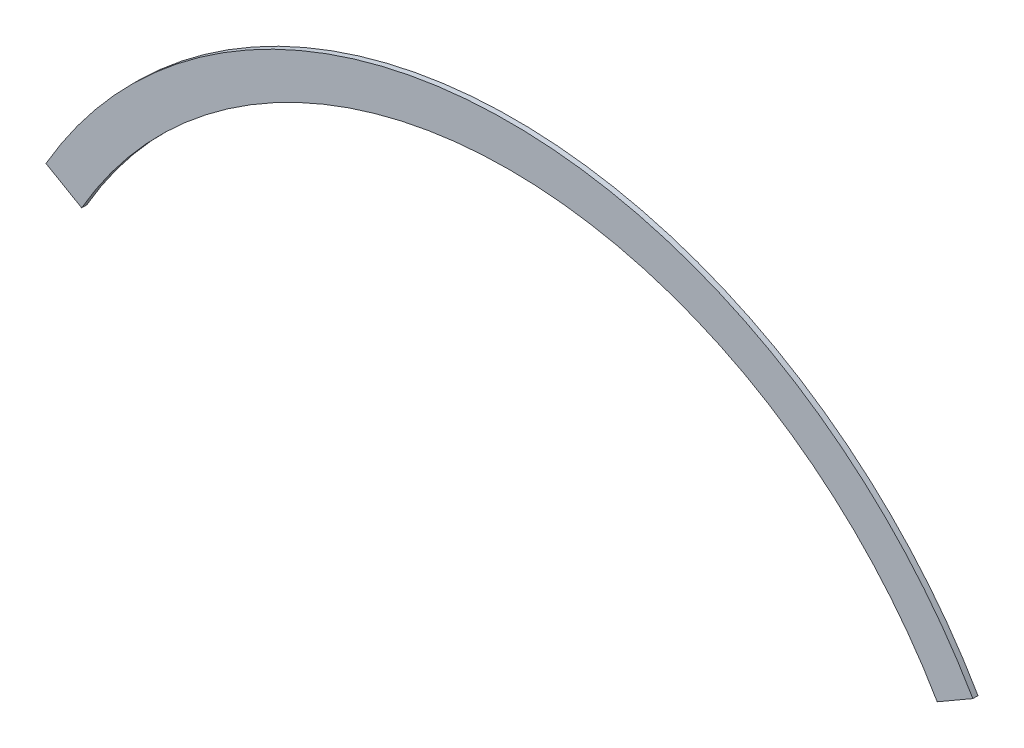
ISO-10303-21;
HEADER;
FILE_DESCRIPTION(('STEP AP214'),'2;1');
FILE_NAME('part.step','',(''),(''),'','','');
FILE_SCHEMA(('AUTOMOTIVE_DESIGN { 1 0 10303 214 1 1 1 1 }'));
ENDSEC;
DATA;
#1=APPLICATION_CONTEXT('core data for automotive mechanical design processes');
#2=APPLICATION_PROTOCOL_DEFINITION('international standard','automotive_design',2000,#1);
#3=PRODUCT_CONTEXT('',#1,'mechanical');
#4=PRODUCT('Part','Part','',(#3));
#5=PRODUCT_RELATED_PRODUCT_CATEGORY('part','',(#4));
#6=PRODUCT_DEFINITION_FORMATION('','',#4);
#7=PRODUCT_DEFINITION_CONTEXT('part definition',#1,'design');
#8=PRODUCT_DEFINITION('design','',#6,#7);
#9=PRODUCT_DEFINITION_SHAPE('','',#8);
#10=(LENGTH_UNIT() NAMED_UNIT(*) SI_UNIT(.MILLI.,.METRE.));
#11=(NAMED_UNIT(*) PLANE_ANGLE_UNIT() SI_UNIT($,.RADIAN.));
#12=(NAMED_UNIT(*) SI_UNIT($,.STERADIAN.) SOLID_ANGLE_UNIT());
#13=UNCERTAINTY_MEASURE_WITH_UNIT(LENGTH_MEASURE(1.E-05),#10,'distance_accuracy_value','');
#14=(GEOMETRIC_REPRESENTATION_CONTEXT(3) GLOBAL_UNCERTAINTY_ASSIGNED_CONTEXT((#13)) GLOBAL_UNIT_ASSIGNED_CONTEXT((#10,
#11,#12)) REPRESENTATION_CONTEXT('',''));
#15=CARTESIAN_POINT('',(0.,0.,0.));
#16=DIRECTION('',(0.,0.,1.));
#17=DIRECTION('',(1.,0.,0.));
#18=AXIS2_PLACEMENT_3D('',#15,#16,#17);
#19=CARTESIAN_POINT('',(0.,0.,1.5875));
#20=DIRECTION('',(0.,0.,-1.));
#21=DIRECTION('',(-1.,0.,0.));
#22=AXIS2_PLACEMENT_3D('',#19,#20,#21);
#23=CYLINDRICAL_SURFACE('',#22,165.1);
#24=CARTESIAN_POINT('',(0.,0.,0.));
#25=DIRECTION('',(0.,0.,1.));
#26=DIRECTION('',(-1.,0.,0.));
#27=AXIS2_PLACEMENT_3D('',#24,#25,#26);
#28=CIRCLE('',#27,165.1);
#29=CARTESIAN_POINT('',(142.980794164811,82.5500000000002,0.));
#30=VERTEX_POINT('',#29);
#31=CARTESIAN_POINT('',(-142.980794164811,82.5500000000002,0.));
#32=VERTEX_POINT('',#31);
#33=EDGE_CURVE('E96',#30,#32,#28,.T.);
#34=ORIENTED_EDGE('',*,*,#33,.T.);
#35=DIRECTION('',(0.,0.,-1.));
#36=VECTOR('',#35,1.);
#37=CARTESIAN_POINT('',(-142.980794164811,82.5500000000002,1.5875));
#38=LINE('',#37,#36);
#39=CARTESIAN_POINT('',(-142.980794164811,82.5500000000002,1.5875));
#40=VERTEX_POINT('',#39);
#41=EDGE_CURVE('E11',#40,#32,#38,.T.);
#42=ORIENTED_EDGE('',*,*,#41,.F.);
#43=CARTESIAN_POINT('',(0.,0.,1.5875));
#44=DIRECTION('',(0.,0.,1.));
#45=DIRECTION('',(-1.,0.,0.));
#46=AXIS2_PLACEMENT_3D('',#43,#44,#45);
#47=CIRCLE('',#46,165.1);
#48=CARTESIAN_POINT('',(142.980794164811,82.5500000000002,1.5875));
#49=VERTEX_POINT('',#48);
#50=EDGE_CURVE('E84',#49,#40,#47,.T.);
#51=ORIENTED_EDGE('',*,*,#50,.F.);
#52=DIRECTION('',(0.,0.,-1.));
#53=VECTOR('',#52,1.);
#54=CARTESIAN_POINT('',(142.980794164811,82.5500000000002,1.5875));
#55=LINE('',#54,#53);
#56=EDGE_CURVE('E92',#49,#30,#55,.T.);
#57=ORIENTED_EDGE('',*,*,#56,.T.);
#58=EDGE_LOOP('',(#34,#42,#51,#57));
#59=FACE_BOUND('',#58,.T.);
#60=ADVANCED_FACE('F33',(#59),#23,.T.);
#61=CARTESIAN_POINT('',(-142.980794164811,82.5500000000002,1.5875));
#62=DIRECTION('',(0.500000000000003,0.866025403784437,0.));
#63=DIRECTION('',(-0.866025403784437,0.500000000000003,0.));
#64=AXIS2_PLACEMENT_3D('',#61,#62,#63);
#65=PLANE('',#64);
#66=DIRECTION('',(0.866025403784437,-0.500000000000003,0.));
#67=VECTOR('',#66,1.);
#68=CARTESIAN_POINT('',(-142.980794164811,82.5500000000002,0.));
#69=LINE('',#68,#67);
#70=CARTESIAN_POINT('',(-131.982271536748,76.2000000000001,0.));
#71=VERTEX_POINT('',#70);
#72=EDGE_CURVE('E88',#32,#71,#69,.T.);
#73=ORIENTED_EDGE('',*,*,#72,.T.);
#74=DIRECTION('',(0.,0.,-1.));
#75=VECTOR('',#74,1.);
#76=CARTESIAN_POINT('',(-131.982271536748,76.2000000000001,1.5875));
#77=LINE('',#76,#75);
#78=CARTESIAN_POINT('',(-131.982271536748,76.2000000000001,1.5875));
#79=VERTEX_POINT('',#78);
#80=EDGE_CURVE('E41',#79,#71,#77,.T.);
#81=ORIENTED_EDGE('',*,*,#80,.F.);
#82=DIRECTION('',(0.866025403784437,-0.500000000000003,0.));
#83=VECTOR('',#82,1.);
#84=CARTESIAN_POINT('',(-142.980794164811,82.5500000000002,1.5875));
#85=LINE('',#84,#83);
#86=EDGE_CURVE('E79',#40,#79,#85,.T.);
#87=ORIENTED_EDGE('',*,*,#86,.F.);
#88=ORIENTED_EDGE('',*,*,#41,.T.);
#89=EDGE_LOOP('',(#73,#81,#87,#88));
#90=FACE_BOUND('',#89,.T.);
#91=ADVANCED_FACE('F87',(#90),#65,.F.);
#92=CARTESIAN_POINT('',(0.,0.,1.5875));
#93=DIRECTION('',(0.,0.,-1.));
#94=DIRECTION('',(-1.,0.,0.));
#95=AXIS2_PLACEMENT_3D('',#92,#93,#94);
#96=CYLINDRICAL_SURFACE('',#95,152.4);
#97=CARTESIAN_POINT('',(0.,0.,0.));
#98=DIRECTION('',(0.,0.,-1.));
#99=DIRECTION('',(-1.,0.,0.));
#100=AXIS2_PLACEMENT_3D('',#97,#98,#99);
#101=CIRCLE('',#100,152.4);
#102=CARTESIAN_POINT('',(131.982271536748,76.2000000000001,0.));
#103=VERTEX_POINT('',#102);
#104=EDGE_CURVE('E66',#71,#103,#101,.T.);
#105=ORIENTED_EDGE('',*,*,#104,.T.);
#106=DIRECTION('',(0.,0.,-1.));
#107=VECTOR('',#106,1.);
#108=CARTESIAN_POINT('',(131.982271536748,76.2000000000001,1.5875));
#109=LINE('',#108,#107);
#110=CARTESIAN_POINT('',(131.982271536748,76.2000000000001,1.5875));
#111=VERTEX_POINT('',#110);
#112=EDGE_CURVE('E89',#111,#103,#109,.T.);
#113=ORIENTED_EDGE('',*,*,#112,.F.);
#114=CARTESIAN_POINT('',(0.,0.,1.5875));
#115=DIRECTION('',(0.,0.,-1.));
#116=DIRECTION('',(-1.,0.,0.));
#117=AXIS2_PLACEMENT_3D('',#114,#115,#116);
#118=CIRCLE('',#117,152.4);
#119=EDGE_CURVE('E82',#79,#111,#118,.T.);
#120=ORIENTED_EDGE('',*,*,#119,.F.);
#121=ORIENTED_EDGE('',*,*,#80,.T.);
#122=EDGE_LOOP('',(#105,#113,#120,#121));
#123=FACE_BOUND('',#122,.T.);
#124=ADVANCED_FACE('F90',(#123),#96,.F.);
#125=CARTESIAN_POINT('',(131.982271536748,76.2000000000001,1.5875));
#126=DIRECTION('',(-0.500000000000003,0.866025403784437,0.));
#127=DIRECTION('',(-0.866025403784437,-0.500000000000003,0.));
#128=AXIS2_PLACEMENT_3D('',#125,#126,#127);
#129=PLANE('',#128);
#130=DIRECTION('',(0.866025403784437,0.500000000000003,0.));
#131=VECTOR('',#130,1.);
#132=CARTESIAN_POINT('',(131.982271536748,76.2000000000001,0.));
#133=LINE('',#132,#131);
#134=EDGE_CURVE('E72',#103,#30,#133,.T.);
#135=ORIENTED_EDGE('',*,*,#134,.T.);
#136=ORIENTED_EDGE('',*,*,#56,.F.);
#137=DIRECTION('',(0.866025403784437,0.500000000000003,0.));
#138=VECTOR('',#137,1.);
#139=CARTESIAN_POINT('',(131.982271536748,76.2000000000001,1.5875));
#140=LINE('',#139,#138);
#141=EDGE_CURVE('E49',#111,#49,#140,.T.);
#142=ORIENTED_EDGE('',*,*,#141,.F.);
#143=ORIENTED_EDGE('',*,*,#112,.T.);
#144=EDGE_LOOP('',(#135,#136,#142,#143));
#145=FACE_BOUND('',#144,.T.);
#146=ADVANCED_FACE('F103',(#145),#129,.F.);
#147=CARTESIAN_POINT('',(0.,0.,1.5875));
#148=DIRECTION('',(0.,0.,-1.));
#149=DIRECTION('',(-1.,0.,0.));
#150=AXIS2_PLACEMENT_3D('',#147,#148,#149);
#151=PLANE('',#150);
#152=ORIENTED_EDGE('',*,*,#50,.T.);
#153=ORIENTED_EDGE('',*,*,#86,.T.);
#154=ORIENTED_EDGE('',*,*,#119,.T.);
#155=ORIENTED_EDGE('',*,*,#141,.T.);
#156=EDGE_LOOP('',(#152,#153,#154,#155));
#157=FACE_BOUND('',#156,.T.);
#158=ADVANCED_FACE('F80',(#157),#151,.F.);
#159=CARTESIAN_POINT('',(0.,0.,0.));
#160=DIRECTION('',(0.,0.,-1.));
#161=DIRECTION('',(-1.,0.,0.));
#162=AXIS2_PLACEMENT_3D('',#159,#160,#161);
#163=PLANE('',#162);
#164=ORIENTED_EDGE('',*,*,#33,.F.);
#165=ORIENTED_EDGE('',*,*,#134,.F.);
#166=ORIENTED_EDGE('',*,*,#104,.F.);
#167=ORIENTED_EDGE('',*,*,#72,.F.);
#168=EDGE_LOOP('',(#164,#165,#166,#167));
#169=FACE_BOUND('',#168,.T.);
#170=ADVANCED_FACE('F106',(#169),#163,.T.);
#171=CLOSED_SHELL('',(#60,#91,#124,#146,#158,#170));
#172=MANIFOLD_SOLID_BREP('B2',#171);
#173=ADVANCED_BREP_SHAPE_REPRESENTATION('',(#18,#172),#14);
#174=SHAPE_DEFINITION_REPRESENTATION(#9,#173);
ENDSEC;
END-ISO-10303-21;
